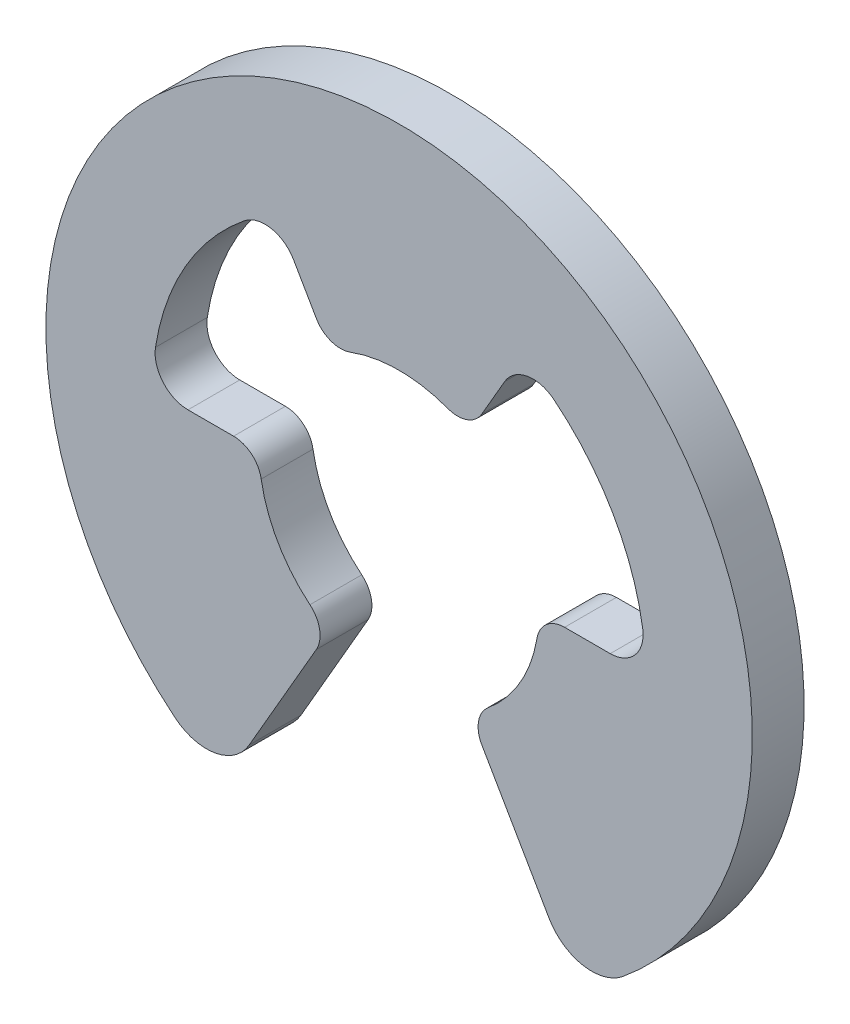
ISO-10303-21;
HEADER;
FILE_DESCRIPTION(('STEP AP214'),'2;1');
FILE_NAME('part.step','',(''),(''),'','','');
FILE_SCHEMA(('AUTOMOTIVE_DESIGN { 1 0 10303 214 1 1 1 1 }'));
ENDSEC;
DATA;
#1=APPLICATION_CONTEXT('core data for automotive mechanical design processes');
#2=APPLICATION_PROTOCOL_DEFINITION('international standard','automotive_design',2000,#1);
#3=PRODUCT_CONTEXT('',#1,'mechanical');
#4=PRODUCT('Part','Part','',(#3));
#5=PRODUCT_RELATED_PRODUCT_CATEGORY('part','',(#4));
#6=PRODUCT_DEFINITION_FORMATION('','',#4);
#7=PRODUCT_DEFINITION_CONTEXT('part definition',#1,'design');
#8=PRODUCT_DEFINITION('design','',#6,#7);
#9=PRODUCT_DEFINITION_SHAPE('','',#8);
#10=(LENGTH_UNIT() NAMED_UNIT(*) SI_UNIT(.MILLI.,.METRE.));
#11=(NAMED_UNIT(*) PLANE_ANGLE_UNIT() SI_UNIT($,.RADIAN.));
#12=(NAMED_UNIT(*) SI_UNIT($,.STERADIAN.) SOLID_ANGLE_UNIT());
#13=UNCERTAINTY_MEASURE_WITH_UNIT(LENGTH_MEASURE(1.E-05),#10,'distance_accuracy_value','');
#14=(GEOMETRIC_REPRESENTATION_CONTEXT(3) GLOBAL_UNCERTAINTY_ASSIGNED_CONTEXT((#13)) GLOBAL_UNIT_ASSIGNED_CONTEXT((#10,
#11,#12)) REPRESENTATION_CONTEXT('',''));
#15=CARTESIAN_POINT('',(0.,0.,0.));
#16=DIRECTION('',(0.,0.,1.));
#17=DIRECTION('',(1.,0.,0.));
#18=AXIS2_PLACEMENT_3D('',#15,#16,#17);
#19=CARTESIAN_POINT('',(2.59745250719345,-3.1692297127061,0.34925));
#20=DIRECTION('',(0.,0.,-1.));
#21=DIRECTION('',(-1.,0.,0.));
#22=AXIS2_PLACEMENT_3D('',#19,#20,#21);
#23=CYLINDRICAL_SURFACE('',#22,0.664845000000036);
#24=DIRECTION('',(0.,0.,-1.));
#25=VECTOR('',#24,1.);
#26=CARTESIAN_POINT('',(2.0216798476144,-3.5016522127062,0.34925));
#27=LINE('',#26,#25);
#28=CARTESIAN_POINT('',(2.0216798476144,-3.5016522127062,0.34925));
#29=VERTEX_POINT('',#28);
#30=CARTESIAN_POINT('',(2.0216798476144,-3.5016522127062,-0.34925));
#31=VERTEX_POINT('',#30);
#32=EDGE_CURVE('E212',#29,#31,#27,.T.);
#33=ORIENTED_EDGE('',*,*,#32,.T.);
#34=CARTESIAN_POINT('',(2.59745250719345,-3.1692297127061,-0.34925));
#35=DIRECTION('',(0.,0.,1.));
#36=DIRECTION('',(1.,0.,0.));
#37=AXIS2_PLACEMENT_3D('',#34,#35,#36);
#38=CIRCLE('',#37,0.664845000000036);
#39=CARTESIAN_POINT('',(3.0188894783745,-3.6834376019365,-0.34925));
#40=VERTEX_POINT('',#39);
#41=EDGE_CURVE('E206',#31,#40,#38,.T.);
#42=ORIENTED_EDGE('',*,*,#41,.T.);
#43=DIRECTION('',(0.,0.,-1.));
#44=VECTOR('',#43,1.);
#45=CARTESIAN_POINT('',(3.0188894783745,-3.6834376019365,0.34925));
#46=LINE('',#45,#44);
#47=CARTESIAN_POINT('',(3.0188894783745,-3.6834376019365,0.34925));
#48=VERTEX_POINT('',#47);
#49=EDGE_CURVE('E11',#48,#40,#46,.T.);
#50=ORIENTED_EDGE('',*,*,#49,.F.);
#51=CARTESIAN_POINT('',(2.59745250719345,-3.1692297127061,0.34925));
#52=DIRECTION('',(0.,0.,1.));
#53=DIRECTION('',(1.,0.,0.));
#54=AXIS2_PLACEMENT_3D('',#51,#52,#53);
#55=CIRCLE('',#54,0.664845000000036);
#56=EDGE_CURVE('E278',#29,#48,#55,.T.);
#57=ORIENTED_EDGE('',*,*,#56,.F.);
#58=EDGE_LOOP('',(#33,#42,#50,#57));
#59=FACE_BOUND('',#58,.T.);
#60=ADVANCED_FACE('F34',(#59),#23,.T.);
#61=CARTESIAN_POINT('',(0.,0.,0.34925));
#62=DIRECTION('',(0.,0.,-1.));
#63=DIRECTION('',(-1.,0.,0.));
#64=AXIS2_PLACEMENT_3D('',#61,#62,#63);
#65=CYLINDRICAL_SURFACE('',#64,4.7625);
#66=ORIENTED_EDGE('',*,*,#49,.T.);
#67=CARTESIAN_POINT('',(0.,0.,-0.34925));
#68=DIRECTION('',(0.,0.,1.));
#69=DIRECTION('',(1.,0.,0.));
#70=AXIS2_PLACEMENT_3D('',#67,#68,#69);
#71=CIRCLE('',#70,4.7625);
#72=CARTESIAN_POINT('',(-3.0188895301229,-3.6834375595243,-0.34925));
#73=VERTEX_POINT('',#72);
#74=EDGE_CURVE('E196',#40,#73,#71,.T.);
#75=ORIENTED_EDGE('',*,*,#74,.T.);
#76=DIRECTION('',(0.,0.,-1.));
#77=VECTOR('',#76,1.);
#78=CARTESIAN_POINT('',(-3.0188895301229,-3.6834375595243,0.34925));
#79=LINE('',#78,#77);
#80=CARTESIAN_POINT('',(-3.0188895301229,-3.6834375595243,0.34925));
#81=VERTEX_POINT('',#80);
#82=EDGE_CURVE('E41',#81,#73,#79,.T.);
#83=ORIENTED_EDGE('',*,*,#82,.F.);
#84=CARTESIAN_POINT('',(0.,0.,0.34925));
#85=DIRECTION('',(0.,0.,1.));
#86=DIRECTION('',(1.,0.,0.));
#87=AXIS2_PLACEMENT_3D('',#84,#85,#86);
#88=CIRCLE('',#87,4.7625);
#89=EDGE_CURVE('E197',#48,#81,#88,.T.);
#90=ORIENTED_EDGE('',*,*,#89,.F.);
#91=EDGE_LOOP('',(#66,#75,#83,#90));
#92=FACE_BOUND('',#91,.T.);
#93=ADVANCED_FACE('F194',(#92),#65,.T.);
#94=CARTESIAN_POINT('',(-2.59745250719345,-3.16922971270609,0.34925));
#95=DIRECTION('',(0.,0.,-1.));
#96=DIRECTION('',(-1.,0.,0.));
#97=AXIS2_PLACEMENT_3D('',#94,#95,#96);
#98=CYLINDRICAL_SURFACE('',#97,0.664845000000043);
#99=ORIENTED_EDGE('',*,*,#82,.T.);
#100=CARTESIAN_POINT('',(-2.59745250719345,-3.16922971270609,-0.34925));
#101=DIRECTION('',(0.,0.,1.));
#102=DIRECTION('',(1.,0.,0.));
#103=AXIS2_PLACEMENT_3D('',#100,#101,#102);
#104=CIRCLE('',#103,0.664845000000043);
#105=CARTESIAN_POINT('',(-2.0216798476144,-3.5016522127062,-0.34925));
#106=VERTEX_POINT('',#105);
#107=EDGE_CURVE('E210',#73,#106,#104,.T.);
#108=ORIENTED_EDGE('',*,*,#107,.T.);
#109=DIRECTION('',(0.,0.,-1.));
#110=VECTOR('',#109,1.);
#111=CARTESIAN_POINT('',(-2.0216798476144,-3.5016522127062,0.34925));
#112=LINE('',#111,#110);
#113=CARTESIAN_POINT('',(-2.0216798476144,-3.5016522127062,0.34925));
#114=VERTEX_POINT('',#113);
#115=EDGE_CURVE('E364',#114,#106,#112,.T.);
#116=ORIENTED_EDGE('',*,*,#115,.F.);
#117=CARTESIAN_POINT('',(-2.59745250719345,-3.16922971270609,0.34925));
#118=DIRECTION('',(0.,0.,1.));
#119=DIRECTION('',(1.,0.,0.));
#120=AXIS2_PLACEMENT_3D('',#117,#118,#119);
#121=CIRCLE('',#120,0.664845000000043);
#122=EDGE_CURVE('E281',#81,#114,#121,.T.);
#123=ORIENTED_EDGE('',*,*,#122,.F.);
#124=EDGE_LOOP('',(#99,#108,#116,#123));
#125=FACE_BOUND('',#124,.T.);
#126=ADVANCED_FACE('F367',(#125),#98,.T.);
#127=CARTESIAN_POINT('',(-2.0216798476144,-3.5016522127062,0.34925));
#128=DIRECTION('',(-0.866025403784446,0.499999999999987,0.));
#129=DIRECTION('',(-0.499999999999987,-0.866025403784446,0.));
#130=AXIS2_PLACEMENT_3D('',#127,#128,#129);
#131=PLANE('',#130);
#132=ORIENTED_EDGE('',*,*,#115,.T.);
#133=DIRECTION('',(0.499999999999987,0.866025403784446,0.));
#134=VECTOR('',#133,1.);
#135=CARTESIAN_POINT('',(-2.0216798476144,-3.5016522127062,-0.34925));
#136=LINE('',#135,#134);
#137=CARTESIAN_POINT('',(-1.1157430666937,-1.9325236797061,-0.34925));
#138=VERTEX_POINT('',#137);
#139=EDGE_CURVE('E216',#106,#138,#136,.T.);
#140=ORIENTED_EDGE('',*,*,#139,.T.);
#141=DIRECTION('',(0.,0.,-1.));
#142=VECTOR('',#141,1.);
#143=CARTESIAN_POINT('',(-1.1157430666937,-1.9325236797061,0.34925));
#144=LINE('',#143,#142);
#145=CARTESIAN_POINT('',(-1.1157430666937,-1.9325236797061,0.34925));
#146=VERTEX_POINT('',#145);
#147=EDGE_CURVE('E362',#146,#138,#144,.T.);
#148=ORIENTED_EDGE('',*,*,#147,.F.);
#149=DIRECTION('',(0.499999999999987,0.866025403784446,0.));
#150=VECTOR('',#149,1.);
#151=CARTESIAN_POINT('',(-2.0216798476144,-3.5016522127062,0.34925));
#152=LINE('',#151,#150);
#153=EDGE_CURVE('E283',#114,#146,#152,.T.);
#154=ORIENTED_EDGE('',*,*,#153,.F.);
#155=EDGE_LOOP('',(#132,#140,#148,#154));
#156=FACE_BOUND('',#155,.T.);
#157=ADVANCED_FACE('F375',(#156),#131,.F.);
#158=CARTESIAN_POINT('',(-1.44239918874694,-1.74392867970605,0.34925));
#159=DIRECTION('',(0.,0.,-1.));
#160=DIRECTION('',(-1.,0.,0.));
#161=AXIS2_PLACEMENT_3D('',#158,#159,#160);
#162=CYLINDRICAL_SURFACE('',#161,0.377189999999838);
#163=ORIENTED_EDGE('',*,*,#147,.T.);
#164=CARTESIAN_POINT('',(-1.44239918874694,-1.74392867970605,-0.34925));
#165=DIRECTION('',(0.,0.,1.));
#166=DIRECTION('',(1.,0.,0.));
#167=AXIS2_PLACEMENT_3D('',#164,#165,#166);
#168=CIRCLE('',#167,0.377189999999838);
#169=CARTESIAN_POINT('',(-1.2019993400678,-1.453273886429,-0.34925));
#170=VERTEX_POINT('',#169);
#171=EDGE_CURVE('E219',#138,#170,#168,.T.);
#172=ORIENTED_EDGE('',*,*,#171,.T.);
#173=DIRECTION('',(0.,0.,-1.));
#174=VECTOR('',#173,1.);
#175=CARTESIAN_POINT('',(-1.2019993400678,-1.453273886429,0.34925));
#176=LINE('',#175,#174);
#177=CARTESIAN_POINT('',(-1.2019993400678,-1.453273886429,0.34925));
#178=VERTEX_POINT('',#177);
#179=EDGE_CURVE('E360',#178,#170,#176,.T.);
#180=ORIENTED_EDGE('',*,*,#179,.F.);
#181=CARTESIAN_POINT('',(-1.44239918874694,-1.74392867970605,0.34925));
#182=DIRECTION('',(0.,0.,1.));
#183=DIRECTION('',(1.,0.,0.));
#184=AXIS2_PLACEMENT_3D('',#181,#182,#183);
#185=CIRCLE('',#184,0.377189999999838);
#186=EDGE_CURVE('E285',#146,#178,#185,.T.);
#187=ORIENTED_EDGE('',*,*,#186,.F.);
#188=EDGE_LOOP('',(#163,#172,#180,#187));
#189=FACE_BOUND('',#188,.T.);
#190=ADVANCED_FACE('F378',(#189),#162,.T.);
#191=CARTESIAN_POINT('',(0.,0.,0.34925));
#192=DIRECTION('',(0.,0.,-1.));
#193=DIRECTION('',(-1.,0.,0.));
#194=AXIS2_PLACEMENT_3D('',#191,#192,#193);
#195=CYLINDRICAL_SURFACE('',#194,1.88594999999999);
#196=ORIENTED_EDGE('',*,*,#179,.T.);
#197=CARTESIAN_POINT('',(0.,0.,-0.34925));
#198=DIRECTION('',(0.,0.,-1.));
#199=DIRECTION('',(-1.,0.,0.));
#200=AXIS2_PLACEMENT_3D('',#197,#198,#199);
#201=CIRCLE('',#200,1.88594999999999);
#202=CARTESIAN_POINT('',(-1.85957177782278,-0.314324999999996,-0.34925));
#203=VERTEX_POINT('',#202);
#204=EDGE_CURVE('E222',#170,#203,#201,.T.);
#205=ORIENTED_EDGE('',*,*,#204,.T.);
#206=DIRECTION('',(0.,0.,-1.));
#207=VECTOR('',#206,1.);
#208=CARTESIAN_POINT('',(-1.85957177782278,-0.314324999999996,0.34925));
#209=LINE('',#208,#207);
#210=CARTESIAN_POINT('',(-1.85957177782278,-0.314324999999996,0.34925));
#211=VERTEX_POINT('',#210);
#212=EDGE_CURVE('E358',#211,#203,#209,.T.);
#213=ORIENTED_EDGE('',*,*,#212,.F.);
#214=CARTESIAN_POINT('',(0.,0.,0.34925));
#215=DIRECTION('',(0.,0.,-1.));
#216=DIRECTION('',(-1.,0.,0.));
#217=AXIS2_PLACEMENT_3D('',#214,#215,#216);
#218=CIRCLE('',#217,1.88594999999999);
#219=EDGE_CURVE('E287',#178,#211,#218,.T.);
#220=ORIENTED_EDGE('',*,*,#219,.F.);
#221=EDGE_LOOP('',(#196,#205,#213,#220));
#222=FACE_BOUND('',#221,.T.);
#223=ADVANCED_FACE('F383',(#222),#195,.F.);
#224=CARTESIAN_POINT('',(-2.23148613338731,-0.377189999999941,0.34925));
#225=DIRECTION('',(0.,0.,-1.));
#226=DIRECTION('',(-1.,0.,0.));
#227=AXIS2_PLACEMENT_3D('',#224,#225,#226);
#228=CYLINDRICAL_SURFACE('',#227,0.377189999999941);
#229=ORIENTED_EDGE('',*,*,#212,.T.);
#230=CARTESIAN_POINT('',(-2.23148613338731,-0.377189999999941,-0.34925));
#231=DIRECTION('',(0.,0.,1.));
#232=DIRECTION('',(1.,0.,0.));
#233=AXIS2_PLACEMENT_3D('',#230,#231,#232);
#234=CIRCLE('',#233,0.377189999999941);
#235=CARTESIAN_POINT('',(-2.2314861333873,0.,-0.34925));
#236=VERTEX_POINT('',#235);
#237=EDGE_CURVE('E225',#203,#236,#234,.T.);
#238=ORIENTED_EDGE('',*,*,#237,.T.);
#239=DIRECTION('',(0.,0.,-1.));
#240=VECTOR('',#239,1.);
#241=CARTESIAN_POINT('',(-2.2314861333873,0.,0.34925));
#242=LINE('',#241,#240);
#243=CARTESIAN_POINT('',(-2.2314861333873,0.,0.34925));
#244=VERTEX_POINT('',#243);
#245=EDGE_CURVE('E356',#244,#236,#242,.T.);
#246=ORIENTED_EDGE('',*,*,#245,.F.);
#247=CARTESIAN_POINT('',(-2.23148613338731,-0.377189999999941,0.34925));
#248=DIRECTION('',(0.,0.,1.));
#249=DIRECTION('',(1.,0.,0.));
#250=AXIS2_PLACEMENT_3D('',#247,#248,#249);
#251=CIRCLE('',#250,0.377189999999941);
#252=EDGE_CURVE('E289',#211,#244,#251,.T.);
#253=ORIENTED_EDGE('',*,*,#252,.F.);
#254=EDGE_LOOP('',(#229,#238,#246,#253));
#255=FACE_BOUND('',#254,.T.);
#256=ADVANCED_FACE('F389',(#255),#228,.T.);
#257=CARTESIAN_POINT('',(-2.2314861333873,0.,0.34925));
#258=DIRECTION('',(0.,-1.,0.));
#259=DIRECTION('',(0.,0.,-1.));
#260=AXIS2_PLACEMENT_3D('',#257,#258,#259);
#261=PLANE('',#260);
#262=ORIENTED_EDGE('',*,*,#245,.T.);
#263=DIRECTION('',(-1.,0.,0.));
#264=VECTOR('',#263,1.);
#265=CARTESIAN_POINT('',(-2.2314861333873,0.,-0.34925));
#266=LINE('',#265,#264);
#267=CARTESIAN_POINT('',(-2.8466962179209,0.,-0.34925));
#268=VERTEX_POINT('',#267);
#269=EDGE_CURVE('E228',#236,#268,#266,.T.);
#270=ORIENTED_EDGE('',*,*,#269,.T.);
#271=DIRECTION('',(0.,0.,-1.));
#272=VECTOR('',#271,1.);
#273=CARTESIAN_POINT('',(-2.8466962179209,0.,0.34925));
#274=LINE('',#273,#272);
#275=CARTESIAN_POINT('',(-2.8466962179209,0.,0.34925));
#276=VERTEX_POINT('',#275);
#277=EDGE_CURVE('E354',#276,#268,#274,.T.);
#278=ORIENTED_EDGE('',*,*,#277,.F.);
#279=DIRECTION('',(-1.,0.,0.));
#280=VECTOR('',#279,1.);
#281=CARTESIAN_POINT('',(-2.2314861333873,0.,0.34925));
#282=LINE('',#281,#280);
#283=EDGE_CURVE('E291',#244,#276,#282,.T.);
#284=ORIENTED_EDGE('',*,*,#283,.F.);
#285=EDGE_LOOP('',(#262,#270,#278,#284));
#286=FACE_BOUND('',#285,.T.);
#287=ADVANCED_FACE('F393',(#286),#261,.F.);
#288=CARTESIAN_POINT('',(-2.84669621792079,0.443230000000095,0.34925));
#289=DIRECTION('',(0.,0.,-1.));
#290=DIRECTION('',(-1.,0.,0.));
#291=AXIS2_PLACEMENT_3D('',#288,#289,#290);
#292=CYLINDRICAL_SURFACE('',#291,0.443230000000095);
#293=ORIENTED_EDGE('',*,*,#277,.T.);
#294=CARTESIAN_POINT('',(-2.84669621792079,0.443230000000095,-0.34925));
#295=DIRECTION('',(0.,0.,-1.));
#296=DIRECTION('',(-1.,0.,0.));
#297=AXIS2_PLACEMENT_3D('',#294,#295,#296);
#298=CIRCLE('',#297,0.443230000000095);
#299=CARTESIAN_POINT('',(-3.2846494751689,0.51141927603273,-0.34925));
#300=VERTEX_POINT('',#299);
#301=EDGE_CURVE('E231',#268,#300,#298,.T.);
#302=ORIENTED_EDGE('',*,*,#301,.T.);
#303=DIRECTION('',(0.,0.,-1.));
#304=VECTOR('',#303,1.);
#305=CARTESIAN_POINT('',(-3.2846494751689,0.51141927603273,0.34925));
#306=LINE('',#305,#304);
#307=CARTESIAN_POINT('',(-3.2846494751689,0.51141927603273,0.34925));
#308=VERTEX_POINT('',#307);
#309=EDGE_CURVE('E352',#308,#300,#306,.T.);
#310=ORIENTED_EDGE('',*,*,#309,.F.);
#311=CARTESIAN_POINT('',(-2.84669621792079,0.443230000000095,0.34925));
#312=DIRECTION('',(0.,0.,-1.));
#313=DIRECTION('',(-1.,0.,0.));
#314=AXIS2_PLACEMENT_3D('',#311,#312,#313);
#315=CIRCLE('',#314,0.443230000000095);
#316=EDGE_CURVE('E293',#276,#308,#315,.T.);
#317=ORIENTED_EDGE('',*,*,#316,.F.);
#318=EDGE_LOOP('',(#293,#302,#310,#317));
#319=FACE_BOUND('',#318,.T.);
#320=ADVANCED_FACE('F398',(#319),#292,.F.);
#321=CARTESIAN_POINT('',(0.,0.,0.34925));
#322=DIRECTION('',(0.,0.,-1.));
#323=DIRECTION('',(-1.,0.,0.));
#324=AXIS2_PLACEMENT_3D('',#321,#322,#323);
#325=CYLINDRICAL_SURFACE('',#324,3.32422500000002);
#326=ORIENTED_EDGE('',*,*,#309,.T.);
#327=CARTESIAN_POINT('',(0.,0.,-0.34925));
#328=DIRECTION('',(0.,0.,-1.));
#329=DIRECTION('',(-1.,0.,0.));
#330=AXIS2_PLACEMENT_3D('',#327,#328,#329);
#331=CIRCLE('',#330,3.32422500000002);
#332=CARTESIAN_POINT('',(-2.0852268390458,2.58888023677191,-0.34925));
#333=VERTEX_POINT('',#332);
#334=EDGE_CURVE('E234',#300,#333,#331,.T.);
#335=ORIENTED_EDGE('',*,*,#334,.T.);
#336=DIRECTION('',(0.,0.,-1.));
#337=VECTOR('',#336,1.);
#338=CARTESIAN_POINT('',(-2.0852268390458,2.58888023677191,0.34925));
#339=LINE('',#338,#337);
#340=CARTESIAN_POINT('',(-2.0852268390458,2.58888023677191,0.34925));
#341=VERTEX_POINT('',#340);
#342=EDGE_CURVE('E350',#341,#333,#339,.T.);
#343=ORIENTED_EDGE('',*,*,#342,.F.);
#344=CARTESIAN_POINT('',(0.,0.,0.34925));
#345=DIRECTION('',(0.,0.,-1.));
#346=DIRECTION('',(-1.,0.,0.));
#347=AXIS2_PLACEMENT_3D('',#344,#345,#346);
#348=CIRCLE('',#347,3.32422500000002);
#349=EDGE_CURVE('E295',#308,#341,#348,.T.);
#350=ORIENTED_EDGE('',*,*,#349,.F.);
#351=EDGE_LOOP('',(#326,#335,#343,#350));
#352=FACE_BOUND('',#351,.T.);
#353=ADVANCED_FACE('F404',(#352),#325,.F.);
#354=CARTESIAN_POINT('',(-1.8071965486798,2.24369624157648,0.34925));
#355=DIRECTION('',(0.,0.,-1.));
#356=DIRECTION('',(-1.,0.,0.));
#357=AXIS2_PLACEMENT_3D('',#354,#355,#356);
#358=CYLINDRICAL_SURFACE('',#357,0.443230000000079);
#359=ORIENTED_EDGE('',*,*,#342,.T.);
#360=CARTESIAN_POINT('',(-1.8071965486798,2.24369624157648,-0.34925));
#361=DIRECTION('',(0.,0.,-1.));
#362=DIRECTION('',(-1.,0.,0.));
#363=AXIS2_PLACEMENT_3D('',#360,#361,#362);
#364=CIRCLE('',#363,0.443230000000079);
#365=CARTESIAN_POINT('',(-1.4233481089604,2.4653112415766,-0.34925));
#366=VERTEX_POINT('',#365);
#367=EDGE_CURVE('E237',#333,#366,#364,.T.);
#368=ORIENTED_EDGE('',*,*,#367,.T.);
#369=DIRECTION('',(0.,0.,-1.));
#370=VECTOR('',#369,1.);
#371=CARTESIAN_POINT('',(-1.4233481089604,2.4653112415766,0.34925));
#372=LINE('',#371,#370);
#373=CARTESIAN_POINT('',(-1.4233481089604,2.4653112415766,0.34925));
#374=VERTEX_POINT('',#373);
#375=EDGE_CURVE('E348',#374,#366,#372,.T.);
#376=ORIENTED_EDGE('',*,*,#375,.F.);
#377=CARTESIAN_POINT('',(-1.8071965486798,2.24369624157648,0.34925));
#378=DIRECTION('',(0.,0.,-1.));
#379=DIRECTION('',(-1.,0.,0.));
#380=AXIS2_PLACEMENT_3D('',#377,#378,#379);
#381=CIRCLE('',#380,0.443230000000079);
#382=EDGE_CURVE('E297',#341,#374,#381,.T.);
#383=ORIENTED_EDGE('',*,*,#382,.F.);
#384=EDGE_LOOP('',(#359,#368,#376,#383));
#385=FACE_BOUND('',#384,.T.);
#386=ADVANCED_FACE('F408',(#385),#358,.F.);
#387=CARTESIAN_POINT('',(-1.4233481089604,2.4653112415766,0.34925));
#388=DIRECTION('',(0.866025403784481,0.499999999999927,0.));
#389=DIRECTION('',(-0.499999999999927,0.866025403784481,0.));
#390=AXIS2_PLACEMENT_3D('',#387,#388,#389);
#391=PLANE('',#390);
#392=ORIENTED_EDGE('',*,*,#375,.T.);
#393=DIRECTION('',(0.499999999999927,-0.866025403784481,0.));
#394=VECTOR('',#393,1.);
#395=CARTESIAN_POINT('',(-1.4233481089604,2.4653112415766,-0.34925));
#396=LINE('',#395,#394);
#397=CARTESIAN_POINT('',(-1.1157430666937,1.9325236797062,-0.34925));
#398=VERTEX_POINT('',#397);
#399=EDGE_CURVE('E240',#366,#398,#396,.T.);
#400=ORIENTED_EDGE('',*,*,#399,.T.);
#401=DIRECTION('',(0.,0.,-1.));
#402=VECTOR('',#401,1.);
#403=CARTESIAN_POINT('',(-1.1157430666937,1.9325236797062,0.34925));
#404=LINE('',#403,#402);
#405=CARTESIAN_POINT('',(-1.1157430666937,1.9325236797062,0.34925));
#406=VERTEX_POINT('',#405);
#407=EDGE_CURVE('E346',#406,#398,#404,.T.);
#408=ORIENTED_EDGE('',*,*,#407,.F.);
#409=DIRECTION('',(0.499999999999927,-0.866025403784481,0.));
#410=VECTOR('',#409,1.);
#411=CARTESIAN_POINT('',(-1.4233481089604,2.4653112415766,0.34925));
#412=LINE('',#411,#410);
#413=EDGE_CURVE('E299',#374,#406,#412,.T.);
#414=ORIENTED_EDGE('',*,*,#413,.F.);
#415=EDGE_LOOP('',(#392,#400,#408,#414));
#416=FACE_BOUND('',#415,.T.);
#417=ADVANCED_FACE('F413',(#416),#391,.F.);
#418=CARTESIAN_POINT('',(-0.789086944640169,2.12111867970628,0.34925));
#419=DIRECTION('',(0.,0.,-1.));
#420=DIRECTION('',(-1.,0.,0.));
#421=AXIS2_PLACEMENT_3D('',#418,#419,#420);
#422=CYLINDRICAL_SURFACE('',#421,0.37719000000011);
#423=ORIENTED_EDGE('',*,*,#407,.T.);
#424=CARTESIAN_POINT('',(-0.789086944640169,2.12111867970628,-0.34925));
#425=DIRECTION('',(0.,0.,1.));
#426=DIRECTION('',(1.,0.,0.));
#427=AXIS2_PLACEMENT_3D('',#424,#425,#426);
#428=CIRCLE('',#427,0.37719000000011);
#429=CARTESIAN_POINT('',(-0.65757244426648,1.7675989033266,-0.34925));
#430=VERTEX_POINT('',#429);
#431=EDGE_CURVE('E243',#398,#430,#428,.T.);
#432=ORIENTED_EDGE('',*,*,#431,.T.);
#433=DIRECTION('',(0.,0.,-1.));
#434=VECTOR('',#433,1.);
#435=CARTESIAN_POINT('',(-0.65757244426648,1.7675989033266,0.34925));
#436=LINE('',#435,#434);
#437=CARTESIAN_POINT('',(-0.65757244426648,1.7675989033266,0.34925));
#438=VERTEX_POINT('',#437);
#439=EDGE_CURVE('E344',#438,#430,#436,.T.);
#440=ORIENTED_EDGE('',*,*,#439,.F.);
#441=CARTESIAN_POINT('',(-0.789086944640169,2.12111867970628,0.34925));
#442=DIRECTION('',(0.,0.,1.));
#443=DIRECTION('',(1.,0.,0.));
#444=AXIS2_PLACEMENT_3D('',#441,#442,#443);
#445=CIRCLE('',#444,0.37719000000011);
#446=EDGE_CURVE('E301',#406,#438,#445,.T.);
#447=ORIENTED_EDGE('',*,*,#446,.F.);
#448=EDGE_LOOP('',(#423,#432,#440,#447));
#449=FACE_BOUND('',#448,.T.);
#450=ADVANCED_FACE('F419',(#449),#422,.T.);
#451=CARTESIAN_POINT('',(0.,0.,0.34925));
#452=DIRECTION('',(0.,0.,-1.));
#453=DIRECTION('',(-1.,0.,0.));
#454=AXIS2_PLACEMENT_3D('',#451,#452,#453);
#455=CYLINDRICAL_SURFACE('',#454,1.88594999999999);
#456=ORIENTED_EDGE('',*,*,#439,.T.);
#457=CARTESIAN_POINT('',(0.,0.,-0.34925));
#458=DIRECTION('',(0.,0.,-1.));
#459=DIRECTION('',(-1.,0.,0.));
#460=AXIS2_PLACEMENT_3D('',#457,#458,#459);
#461=CIRCLE('',#460,1.88594999999999);
#462=CARTESIAN_POINT('',(0.657572453866854,1.76759889975511,-0.34925));
#463=VERTEX_POINT('',#462);
#464=EDGE_CURVE('E246',#430,#463,#461,.T.);
#465=ORIENTED_EDGE('',*,*,#464,.T.);
#466=DIRECTION('',(0.,0.,-1.));
#467=VECTOR('',#466,1.);
#468=CARTESIAN_POINT('',(0.657572453866854,1.76759889975511,0.34925));
#469=LINE('',#468,#467);
#470=CARTESIAN_POINT('',(0.657572453866854,1.76759889975511,0.34925));
#471=VERTEX_POINT('',#470);
#472=EDGE_CURVE('E342',#471,#463,#469,.T.);
#473=ORIENTED_EDGE('',*,*,#472,.F.);
#474=CARTESIAN_POINT('',(0.,0.,0.34925));
#475=DIRECTION('',(0.,0.,-1.));
#476=DIRECTION('',(-1.,0.,0.));
#477=AXIS2_PLACEMENT_3D('',#474,#475,#476);
#478=CIRCLE('',#477,1.88594999999999);
#479=EDGE_CURVE('E303',#438,#471,#478,.T.);
#480=ORIENTED_EDGE('',*,*,#479,.F.);
#481=EDGE_LOOP('',(#456,#465,#473,#480));
#482=FACE_BOUND('',#481,.T.);
#483=ADVANCED_FACE('F423',(#482),#455,.F.);
#484=CARTESIAN_POINT('',(0.789086944640139,2.12111867970632,0.34925));
#485=DIRECTION('',(0.,0.,-1.));
#486=DIRECTION('',(-1.,0.,0.));
#487=AXIS2_PLACEMENT_3D('',#484,#485,#486);
#488=CYLINDRICAL_SURFACE('',#487,0.377190000000155);
#489=ORIENTED_EDGE('',*,*,#472,.T.);
#490=CARTESIAN_POINT('',(0.789086944640139,2.12111867970632,-0.34925));
#491=DIRECTION('',(0.,0.,1.));
#492=DIRECTION('',(1.,0.,0.));
#493=AXIS2_PLACEMENT_3D('',#490,#491,#492);
#494=CIRCLE('',#493,0.377190000000155);
#495=CARTESIAN_POINT('',(1.1157430666937,1.9325236797062,-0.34925));
#496=VERTEX_POINT('',#495);
#497=EDGE_CURVE('E249',#463,#496,#494,.T.);
#498=ORIENTED_EDGE('',*,*,#497,.T.);
#499=DIRECTION('',(0.,0.,-1.));
#500=VECTOR('',#499,1.);
#501=CARTESIAN_POINT('',(1.1157430666937,1.9325236797062,0.34925));
#502=LINE('',#501,#500);
#503=CARTESIAN_POINT('',(1.1157430666937,1.9325236797062,0.34925));
#504=VERTEX_POINT('',#503);
#505=EDGE_CURVE('E340',#504,#496,#502,.T.);
#506=ORIENTED_EDGE('',*,*,#505,.F.);
#507=CARTESIAN_POINT('',(0.789086944640139,2.12111867970632,0.34925));
#508=DIRECTION('',(0.,0.,1.));
#509=DIRECTION('',(1.,0.,0.));
#510=AXIS2_PLACEMENT_3D('',#507,#508,#509);
#511=CIRCLE('',#510,0.377190000000155);
#512=EDGE_CURVE('E305',#471,#504,#511,.T.);
#513=ORIENTED_EDGE('',*,*,#512,.F.);
#514=EDGE_LOOP('',(#489,#498,#506,#513));
#515=FACE_BOUND('',#514,.T.);
#516=ADVANCED_FACE('F428',(#515),#488,.T.);
#517=CARTESIAN_POINT('',(1.1157430666937,1.9325236797062,0.34925));
#518=DIRECTION('',(-0.866025403784481,0.499999999999927,0.));
#519=DIRECTION('',(-0.499999999999927,-0.866025403784481,0.));
#520=AXIS2_PLACEMENT_3D('',#517,#518,#519);
#521=PLANE('',#520);
#522=ORIENTED_EDGE('',*,*,#505,.T.);
#523=DIRECTION('',(0.499999999999927,0.866025403784481,0.));
#524=VECTOR('',#523,1.);
#525=CARTESIAN_POINT('',(1.1157430666937,1.9325236797062,-0.34925));
#526=LINE('',#525,#524);
#527=CARTESIAN_POINT('',(1.4233481089604,2.4653112415766,-0.34925));
#528=VERTEX_POINT('',#527);
#529=EDGE_CURVE('E252',#496,#528,#526,.T.);
#530=ORIENTED_EDGE('',*,*,#529,.T.);
#531=DIRECTION('',(0.,0.,-1.));
#532=VECTOR('',#531,1.);
#533=CARTESIAN_POINT('',(1.4233481089604,2.4653112415766,0.34925));
#534=LINE('',#533,#532);
#535=CARTESIAN_POINT('',(1.4233481089604,2.4653112415766,0.34925));
#536=VERTEX_POINT('',#535);
#537=EDGE_CURVE('E338',#536,#528,#534,.T.);
#538=ORIENTED_EDGE('',*,*,#537,.F.);
#539=DIRECTION('',(0.499999999999927,0.866025403784481,0.));
#540=VECTOR('',#539,1.);
#541=CARTESIAN_POINT('',(1.1157430666937,1.9325236797062,0.34925));
#542=LINE('',#541,#540);
#543=EDGE_CURVE('E307',#504,#536,#542,.T.);
#544=ORIENTED_EDGE('',*,*,#543,.F.);
#545=EDGE_LOOP('',(#522,#530,#538,#544));
#546=FACE_BOUND('',#545,.T.);
#547=ADVANCED_FACE('F434',(#546),#521,.F.);
#548=CARTESIAN_POINT('',(1.80719654867977,2.24369624157657,0.34925));
#549=DIRECTION('',(0.,0.,-1.));
#550=DIRECTION('',(-1.,0.,0.));
#551=AXIS2_PLACEMENT_3D('',#548,#549,#550);
#552=CYLINDRICAL_SURFACE('',#551,0.443230000000004);
#553=ORIENTED_EDGE('',*,*,#537,.T.);
#554=CARTESIAN_POINT('',(1.80719654867977,2.24369624157657,-0.34925));
#555=DIRECTION('',(0.,0.,-1.));
#556=DIRECTION('',(-1.,0.,0.));
#557=AXIS2_PLACEMENT_3D('',#554,#555,#556);
#558=CIRCLE('',#557,0.443230000000004);
#559=CARTESIAN_POINT('',(2.0852267663409,2.5888802953324,-0.34925));
#560=VERTEX_POINT('',#559);
#561=EDGE_CURVE('E255',#528,#560,#558,.T.);
#562=ORIENTED_EDGE('',*,*,#561,.T.);
#563=DIRECTION('',(0.,0.,-1.));
#564=VECTOR('',#563,1.);
#565=CARTESIAN_POINT('',(2.0852267663409,2.5888802953324,0.34925));
#566=LINE('',#565,#564);
#567=CARTESIAN_POINT('',(2.0852267663409,2.5888802953324,0.34925));
#568=VERTEX_POINT('',#567);
#569=EDGE_CURVE('E336',#568,#560,#566,.T.);
#570=ORIENTED_EDGE('',*,*,#569,.F.);
#571=CARTESIAN_POINT('',(1.80719654867977,2.24369624157657,0.34925));
#572=DIRECTION('',(0.,0.,-1.));
#573=DIRECTION('',(-1.,0.,0.));
#574=AXIS2_PLACEMENT_3D('',#571,#572,#573);
#575=CIRCLE('',#574,0.443230000000004);
#576=EDGE_CURVE('E309',#536,#568,#575,.T.);
#577=ORIENTED_EDGE('',*,*,#576,.F.);
#578=EDGE_LOOP('',(#553,#562,#570,#577));
#579=FACE_BOUND('',#578,.T.);
#580=ADVANCED_FACE('F438',(#579),#552,.F.);
#581=CARTESIAN_POINT('',(0.,0.,0.34925));
#582=DIRECTION('',(0.,0.,-1.));
#583=DIRECTION('',(-1.,0.,0.));
#584=AXIS2_PLACEMENT_3D('',#581,#582,#583);
#585=CYLINDRICAL_SURFACE('',#584,3.324225);
#586=ORIENTED_EDGE('',*,*,#569,.T.);
#587=CARTESIAN_POINT('',(0.,0.,-0.34925));
#588=DIRECTION('',(0.,0.,-1.));
#589=DIRECTION('',(-1.,0.,0.));
#590=AXIS2_PLACEMENT_3D('',#587,#588,#589);
#591=CIRCLE('',#590,3.324225);
#592=CARTESIAN_POINT('',(3.28464948221639,0.511419230769228,-0.34925));
#593=VERTEX_POINT('',#592);
#594=EDGE_CURVE('E258',#560,#593,#591,.T.);
#595=ORIENTED_EDGE('',*,*,#594,.T.);
#596=DIRECTION('',(0.,0.,-1.));
#597=VECTOR('',#596,1.);
#598=CARTESIAN_POINT('',(3.28464948221639,0.511419230769228,0.34925));
#599=LINE('',#598,#597);
#600=CARTESIAN_POINT('',(3.28464948221639,0.511419230769228,0.34925));
#601=VERTEX_POINT('',#600);
#602=EDGE_CURVE('E334',#601,#593,#599,.T.);
#603=ORIENTED_EDGE('',*,*,#602,.F.);
#604=CARTESIAN_POINT('',(0.,0.,0.34925));
#605=DIRECTION('',(0.,0.,-1.));
#606=DIRECTION('',(-1.,0.,0.));
#607=AXIS2_PLACEMENT_3D('',#604,#605,#606);
#608=CIRCLE('',#607,3.324225);
#609=EDGE_CURVE('E311',#568,#601,#608,.T.);
#610=ORIENTED_EDGE('',*,*,#609,.F.);
#611=EDGE_LOOP('',(#586,#595,#603,#610));
#612=FACE_BOUND('',#611,.T.);
#613=ADVANCED_FACE('F443',(#612),#585,.F.);
#614=CARTESIAN_POINT('',(2.8466962179208,0.443230000000067,0.34925));
#615=DIRECTION('',(0.,0.,-1.));
#616=DIRECTION('',(-1.,0.,0.));
#617=AXIS2_PLACEMENT_3D('',#614,#615,#616);
#618=CYLINDRICAL_SURFACE('',#617,0.443230000000067);
#619=ORIENTED_EDGE('',*,*,#602,.T.);
#620=CARTESIAN_POINT('',(2.8466962179208,0.443230000000067,-0.34925));
#621=DIRECTION('',(0.,0.,-1.));
#622=DIRECTION('',(-1.,0.,0.));
#623=AXIS2_PLACEMENT_3D('',#620,#621,#622);
#624=CIRCLE('',#623,0.443230000000067);
#625=CARTESIAN_POINT('',(2.8466962179209,0.,-0.34925));
#626=VERTEX_POINT('',#625);
#627=EDGE_CURVE('E261',#593,#626,#624,.T.);
#628=ORIENTED_EDGE('',*,*,#627,.T.);
#629=DIRECTION('',(0.,0.,-1.));
#630=VECTOR('',#629,1.);
#631=CARTESIAN_POINT('',(2.8466962179209,0.,0.34925));
#632=LINE('',#631,#630);
#633=CARTESIAN_POINT('',(2.8466962179209,0.,0.34925));
#634=VERTEX_POINT('',#633);
#635=EDGE_CURVE('E332',#634,#626,#632,.T.);
#636=ORIENTED_EDGE('',*,*,#635,.F.);
#637=CARTESIAN_POINT('',(2.8466962179208,0.443230000000067,0.34925));
#638=DIRECTION('',(0.,0.,-1.));
#639=DIRECTION('',(-1.,0.,0.));
#640=AXIS2_PLACEMENT_3D('',#637,#638,#639);
#641=CIRCLE('',#640,0.443230000000067);
#642=EDGE_CURVE('E313',#601,#634,#641,.T.);
#643=ORIENTED_EDGE('',*,*,#642,.F.);
#644=EDGE_LOOP('',(#619,#628,#636,#643));
#645=FACE_BOUND('',#644,.T.);
#646=ADVANCED_FACE('F449',(#645),#618,.F.);
#647=CARTESIAN_POINT('',(2.8466962179209,0.,0.34925));
#648=DIRECTION('',(0.,-1.,0.));
#649=DIRECTION('',(0.,0.,-1.));
#650=AXIS2_PLACEMENT_3D('',#647,#648,#649);
#651=PLANE('',#650);
#652=ORIENTED_EDGE('',*,*,#635,.T.);
#653=DIRECTION('',(-1.,0.,0.));
#654=VECTOR('',#653,1.);
#655=CARTESIAN_POINT('',(2.8466962179209,0.,-0.34925));
#656=LINE('',#655,#654);
#657=CARTESIAN_POINT('',(2.2314861333873,0.,-0.34925));
#658=VERTEX_POINT('',#657);
#659=EDGE_CURVE('E264',#626,#658,#656,.T.);
#660=ORIENTED_EDGE('',*,*,#659,.T.);
#661=DIRECTION('',(0.,0.,-1.));
#662=VECTOR('',#661,1.);
#663=CARTESIAN_POINT('',(2.2314861333873,0.,0.34925));
#664=LINE('',#663,#662);
#665=CARTESIAN_POINT('',(2.2314861333873,0.,0.34925));
#666=VERTEX_POINT('',#665);
#667=EDGE_CURVE('E330',#666,#658,#664,.T.);
#668=ORIENTED_EDGE('',*,*,#667,.F.);
#669=DIRECTION('',(-1.,0.,0.));
#670=VECTOR('',#669,1.);
#671=CARTESIAN_POINT('',(2.8466962179209,0.,0.34925));
#672=LINE('',#671,#670);
#673=EDGE_CURVE('E315',#634,#666,#672,.T.);
#674=ORIENTED_EDGE('',*,*,#673,.F.);
#675=EDGE_LOOP('',(#652,#660,#668,#674));
#676=FACE_BOUND('',#675,.T.);
#677=ADVANCED_FACE('F453',(#676),#651,.F.);
#678=CARTESIAN_POINT('',(2.23148613338731,-0.377189999999941,0.34925));
#679=DIRECTION('',(0.,0.,-1.));
#680=DIRECTION('',(-1.,0.,0.));
#681=AXIS2_PLACEMENT_3D('',#678,#679,#680);
#682=CYLINDRICAL_SURFACE('',#681,0.377189999999941);
#683=ORIENTED_EDGE('',*,*,#667,.T.);
#684=CARTESIAN_POINT('',(2.23148613338731,-0.377189999999941,-0.34925));
#685=DIRECTION('',(0.,0.,1.));
#686=DIRECTION('',(1.,0.,0.));
#687=AXIS2_PLACEMENT_3D('',#684,#685,#686);
#688=CIRCLE('',#687,0.377189999999941);
#689=CARTESIAN_POINT('',(1.8595717778228,-0.314325,-0.34925));
#690=VERTEX_POINT('',#689);
#691=EDGE_CURVE('E267',#658,#690,#688,.T.);
#692=ORIENTED_EDGE('',*,*,#691,.T.);
#693=DIRECTION('',(0.,0.,-1.));
#694=VECTOR('',#693,1.);
#695=CARTESIAN_POINT('',(1.8595717778228,-0.314325,0.34925));
#696=LINE('',#695,#694);
#697=CARTESIAN_POINT('',(1.8595717778228,-0.314325,0.34925));
#698=VERTEX_POINT('',#697);
#699=EDGE_CURVE('E328',#698,#690,#696,.T.);
#700=ORIENTED_EDGE('',*,*,#699,.F.);
#701=CARTESIAN_POINT('',(2.23148613338731,-0.377189999999941,0.34925));
#702=DIRECTION('',(0.,0.,1.));
#703=DIRECTION('',(1.,0.,0.));
#704=AXIS2_PLACEMENT_3D('',#701,#702,#703);
#705=CIRCLE('',#704,0.377189999999941);
#706=EDGE_CURVE('E317',#666,#698,#705,.T.);
#707=ORIENTED_EDGE('',*,*,#706,.F.);
#708=EDGE_LOOP('',(#683,#692,#700,#707));
#709=FACE_BOUND('',#708,.T.);
#710=ADVANCED_FACE('F458',(#709),#682,.T.);
#711=CARTESIAN_POINT('',(0.,0.,0.34925));
#712=DIRECTION('',(0.,0.,-1.));
#713=DIRECTION('',(-1.,0.,0.));
#714=AXIS2_PLACEMENT_3D('',#711,#712,#713);
#715=CYLINDRICAL_SURFACE('',#714,1.88594999999999);
#716=ORIENTED_EDGE('',*,*,#699,.T.);
#717=CARTESIAN_POINT('',(0.,0.,-0.34925));
#718=DIRECTION('',(0.,0.,-1.));
#719=DIRECTION('',(-1.,0.,0.));
#720=AXIS2_PLACEMENT_3D('',#717,#718,#719);
#721=CIRCLE('',#720,1.88594999999999);
#722=CARTESIAN_POINT('',(1.20199932395592,-1.45327389975512,-0.34925));
#723=VERTEX_POINT('',#722);
#724=EDGE_CURVE('E270',#690,#723,#721,.T.);
#725=ORIENTED_EDGE('',*,*,#724,.T.);
#726=DIRECTION('',(0.,0.,-1.));
#727=VECTOR('',#726,1.);
#728=CARTESIAN_POINT('',(1.20199932395592,-1.45327389975512,0.34925));
#729=LINE('',#728,#727);
#730=CARTESIAN_POINT('',(1.20199932395592,-1.45327389975512,0.34925));
#731=VERTEX_POINT('',#730);
#732=EDGE_CURVE('E326',#731,#723,#729,.T.);
#733=ORIENTED_EDGE('',*,*,#732,.F.);
#734=CARTESIAN_POINT('',(0.,0.,0.34925));
#735=DIRECTION('',(0.,0.,-1.));
#736=DIRECTION('',(-1.,0.,0.));
#737=AXIS2_PLACEMENT_3D('',#734,#735,#736);
#738=CIRCLE('',#737,1.88594999999999);
#739=EDGE_CURVE('E319',#698,#731,#738,.T.);
#740=ORIENTED_EDGE('',*,*,#739,.F.);
#741=EDGE_LOOP('',(#716,#725,#733,#740));
#742=FACE_BOUND('',#741,.T.);
#743=ADVANCED_FACE('F462',(#742),#715,.F.);
#744=CARTESIAN_POINT('',(1.44239918874706,-1.7439286797061,0.34925));
#745=DIRECTION('',(0.,0.,-1.));
#746=DIRECTION('',(-1.,0.,0.));
#747=AXIS2_PLACEMENT_3D('',#744,#745,#746);
#748=CYLINDRICAL_SURFACE('',#747,0.377189999999965);
#749=ORIENTED_EDGE('',*,*,#732,.T.);
#750=CARTESIAN_POINT('',(1.44239918874706,-1.7439286797061,-0.34925));
#751=DIRECTION('',(0.,0.,1.));
#752=DIRECTION('',(1.,0.,0.));
#753=AXIS2_PLACEMENT_3D('',#750,#751,#752);
#754=CIRCLE('',#753,0.377189999999965);
#755=CARTESIAN_POINT('',(1.1157430666937,-1.9325236797062,-0.34925));
#756=VERTEX_POINT('',#755);
#757=EDGE_CURVE('E273',#723,#756,#754,.T.);
#758=ORIENTED_EDGE('',*,*,#757,.T.);
#759=DIRECTION('',(0.,0.,-1.));
#760=VECTOR('',#759,1.);
#761=CARTESIAN_POINT('',(1.1157430666937,-1.9325236797062,0.34925));
#762=LINE('',#761,#760);
#763=CARTESIAN_POINT('',(1.1157430666937,-1.9325236797062,0.34925));
#764=VERTEX_POINT('',#763);
#765=EDGE_CURVE('E324',#764,#756,#762,.T.);
#766=ORIENTED_EDGE('',*,*,#765,.F.);
#767=CARTESIAN_POINT('',(1.44239918874706,-1.7439286797061,0.34925));
#768=DIRECTION('',(0.,0.,1.));
#769=DIRECTION('',(1.,0.,0.));
#770=AXIS2_PLACEMENT_3D('',#767,#768,#769);
#771=CIRCLE('',#770,0.377189999999965);
#772=EDGE_CURVE('E53',#731,#764,#771,.T.);
#773=ORIENTED_EDGE('',*,*,#772,.F.);
#774=EDGE_LOOP('',(#749,#758,#766,#773));
#775=FACE_BOUND('',#774,.T.);
#776=ADVANCED_FACE('F466',(#775),#748,.T.);
#777=CARTESIAN_POINT('',(1.1157430666937,-1.9325236797062,0.34925));
#778=DIRECTION('',(0.866025403784432,0.500000000000011,0.));
#779=DIRECTION('',(-0.500000000000011,0.866025403784432,0.));
#780=AXIS2_PLACEMENT_3D('',#777,#778,#779);
#781=PLANE('',#780);
#782=ORIENTED_EDGE('',*,*,#765,.T.);
#783=DIRECTION('',(0.500000000000011,-0.866025403784432,0.));
#784=VECTOR('',#783,1.);
#785=CARTESIAN_POINT('',(1.1157430666937,-1.9325236797062,-0.34925));
#786=LINE('',#785,#784);
#787=EDGE_CURVE('E276',#756,#31,#786,.T.);
#788=ORIENTED_EDGE('',*,*,#787,.T.);
#789=ORIENTED_EDGE('',*,*,#32,.F.);
#790=DIRECTION('',(0.500000000000011,-0.866025403784432,0.));
#791=VECTOR('',#790,1.);
#792=CARTESIAN_POINT('',(1.1157430666937,-1.9325236797062,0.34925));
#793=LINE('',#792,#791);
#794=EDGE_CURVE('E48',#764,#29,#793,.T.);
#795=ORIENTED_EDGE('',*,*,#794,.F.);
#796=EDGE_LOOP('',(#782,#788,#789,#795));
#797=FACE_BOUND('',#796,.T.);
#798=ADVANCED_FACE('F468',(#797),#781,.F.);
#799=CARTESIAN_POINT('',(2.59745250719345,-3.1692297127061,0.34925));
#800=DIRECTION('',(0.,0.,1.));
#801=DIRECTION('',(1.,0.,0.));
#802=AXIS2_PLACEMENT_3D('',#799,#800,#801);
#803=PLANE('',#802);
#804=ORIENTED_EDGE('',*,*,#56,.T.);
#805=ORIENTED_EDGE('',*,*,#89,.T.);
#806=ORIENTED_EDGE('',*,*,#122,.T.);
#807=ORIENTED_EDGE('',*,*,#153,.T.);
#808=ORIENTED_EDGE('',*,*,#186,.T.);
#809=ORIENTED_EDGE('',*,*,#219,.T.);
#810=ORIENTED_EDGE('',*,*,#252,.T.);
#811=ORIENTED_EDGE('',*,*,#283,.T.);
#812=ORIENTED_EDGE('',*,*,#316,.T.);
#813=ORIENTED_EDGE('',*,*,#349,.T.);
#814=ORIENTED_EDGE('',*,*,#382,.T.);
#815=ORIENTED_EDGE('',*,*,#413,.T.);
#816=ORIENTED_EDGE('',*,*,#446,.T.);
#817=ORIENTED_EDGE('',*,*,#479,.T.);
#818=ORIENTED_EDGE('',*,*,#512,.T.);
#819=ORIENTED_EDGE('',*,*,#543,.T.);
#820=ORIENTED_EDGE('',*,*,#576,.T.);
#821=ORIENTED_EDGE('',*,*,#609,.T.);
#822=ORIENTED_EDGE('',*,*,#642,.T.);
#823=ORIENTED_EDGE('',*,*,#673,.T.);
#824=ORIENTED_EDGE('',*,*,#706,.T.);
#825=ORIENTED_EDGE('',*,*,#739,.T.);
#826=ORIENTED_EDGE('',*,*,#772,.T.);
#827=ORIENTED_EDGE('',*,*,#794,.T.);
#828=EDGE_LOOP('',(#804,#805,#806,#807,#808,#809,#810,#811,#812,#813,#814,#815,#816,#817,#818,
#819,#820,#821,#822,#823,#824,#825,#826,#827));
#829=FACE_BOUND('',#828,.T.);
#830=ADVANCED_FACE('F370',(#829),#803,.T.);
#831=CARTESIAN_POINT('',(2.59745250719345,-3.1692297127061,-0.34925));
#832=DIRECTION('',(0.,0.,1.));
#833=DIRECTION('',(1.,0.,0.));
#834=AXIS2_PLACEMENT_3D('',#831,#832,#833);
#835=PLANE('',#834);
#836=ORIENTED_EDGE('',*,*,#41,.F.);
#837=ORIENTED_EDGE('',*,*,#787,.F.);
#838=ORIENTED_EDGE('',*,*,#757,.F.);
#839=ORIENTED_EDGE('',*,*,#724,.F.);
#840=ORIENTED_EDGE('',*,*,#691,.F.);
#841=ORIENTED_EDGE('',*,*,#659,.F.);
#842=ORIENTED_EDGE('',*,*,#627,.F.);
#843=ORIENTED_EDGE('',*,*,#594,.F.);
#844=ORIENTED_EDGE('',*,*,#561,.F.);
#845=ORIENTED_EDGE('',*,*,#529,.F.);
#846=ORIENTED_EDGE('',*,*,#497,.F.);
#847=ORIENTED_EDGE('',*,*,#464,.F.);
#848=ORIENTED_EDGE('',*,*,#431,.F.);
#849=ORIENTED_EDGE('',*,*,#399,.F.);
#850=ORIENTED_EDGE('',*,*,#367,.F.);
#851=ORIENTED_EDGE('',*,*,#334,.F.);
#852=ORIENTED_EDGE('',*,*,#301,.F.);
#853=ORIENTED_EDGE('',*,*,#269,.F.);
#854=ORIENTED_EDGE('',*,*,#237,.F.);
#855=ORIENTED_EDGE('',*,*,#204,.F.);
#856=ORIENTED_EDGE('',*,*,#171,.F.);
#857=ORIENTED_EDGE('',*,*,#139,.F.);
#858=ORIENTED_EDGE('',*,*,#107,.F.);
#859=ORIENTED_EDGE('',*,*,#74,.F.);
#860=EDGE_LOOP('',(#836,#837,#838,#839,#840,#841,#842,#843,#844,#845,#846,#847,#848,#849,#850,
#851,#852,#853,#854,#855,#856,#857,#858,#859));
#861=FACE_BOUND('',#860,.T.);
#862=ADVANCED_FACE('F204',(#861),#835,.F.);
#863=CLOSED_SHELL('',(#60,#93,#126,#157,#190,#223,#256,#287,#320,#353,#386,#417,#450,#483,#516,
#547,#580,#613,#646,#677,#710,#743,#776,#798,#830,#862));
#864=MANIFOLD_SOLID_BREP('B2',#863);
#865=ADVANCED_BREP_SHAPE_REPRESENTATION('',(#18,#864),#14);
#866=SHAPE_DEFINITION_REPRESENTATION(#9,#865);
ENDSEC;
END-ISO-10303-21;
